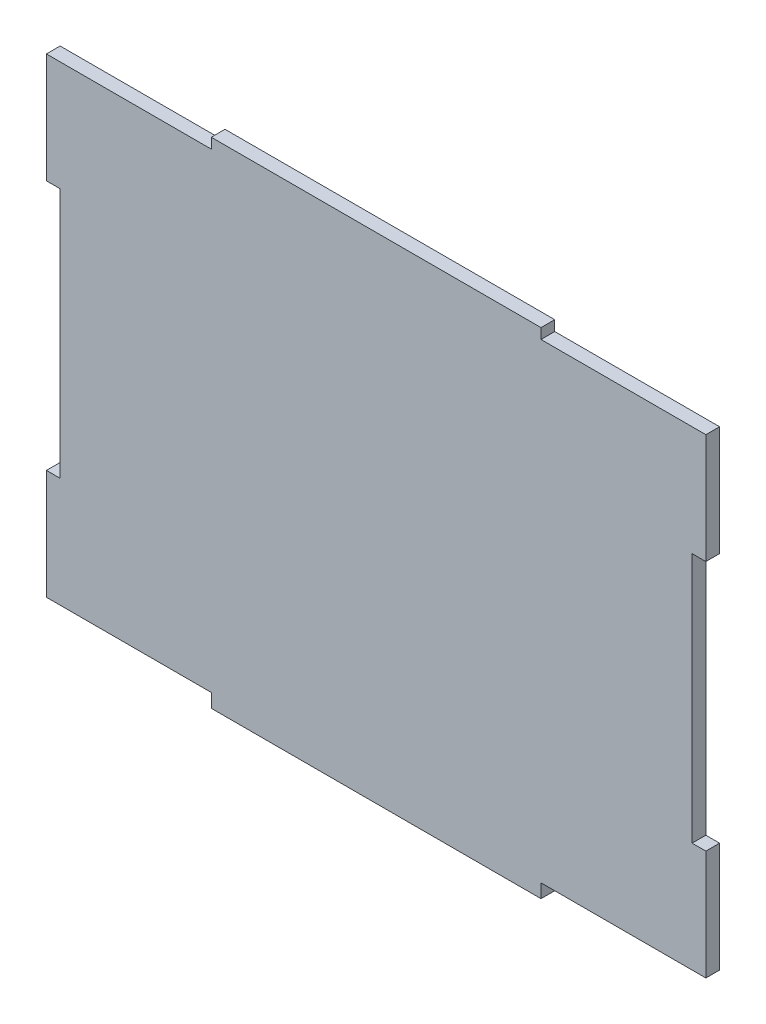
ISO-10303-21;
HEADER;
FILE_DESCRIPTION(('STEP AP214'),'2;1');
FILE_NAME('part.step','',(''),(''),'','','');
FILE_SCHEMA(('AUTOMOTIVE_DESIGN { 1 0 10303 214 1 1 1 1 }'));
ENDSEC;
DATA;
#1=APPLICATION_CONTEXT('core data for automotive mechanical design processes');
#2=APPLICATION_PROTOCOL_DEFINITION('international standard','automotive_design',2000,#1);
#3=PRODUCT_CONTEXT('',#1,'mechanical');
#4=PRODUCT('Part','Part','',(#3));
#5=PRODUCT_RELATED_PRODUCT_CATEGORY('part','',(#4));
#6=PRODUCT_DEFINITION_FORMATION('','',#4);
#7=PRODUCT_DEFINITION_CONTEXT('part definition',#1,'design');
#8=PRODUCT_DEFINITION('design','',#6,#7);
#9=PRODUCT_DEFINITION_SHAPE('','',#8);
#10=(LENGTH_UNIT() NAMED_UNIT(*) SI_UNIT(.MILLI.,.METRE.));
#11=(NAMED_UNIT(*) PLANE_ANGLE_UNIT() SI_UNIT($,.RADIAN.));
#12=(NAMED_UNIT(*) SI_UNIT($,.STERADIAN.) SOLID_ANGLE_UNIT());
#13=UNCERTAINTY_MEASURE_WITH_UNIT(LENGTH_MEASURE(1.E-05),#10,'distance_accuracy_value','');
#14=(GEOMETRIC_REPRESENTATION_CONTEXT(3) GLOBAL_UNCERTAINTY_ASSIGNED_CONTEXT((#13)) GLOBAL_UNIT_ASSIGNED_CONTEXT((#10,
#11,#12)) REPRESENTATION_CONTEXT('',''));
#15=CARTESIAN_POINT('',(0.,0.,0.));
#16=DIRECTION('',(0.,0.,1.));
#17=DIRECTION('',(1.,0.,0.));
#18=AXIS2_PLACEMENT_3D('',#15,#16,#17);
#19=CARTESIAN_POINT('',(50.0272444260496,49.5737704918033,2.));
#20=DIRECTION('',(-1.,0.,0.));
#21=DIRECTION('',(0.,0.,1.));
#22=AXIS2_PLACEMENT_3D('',#19,#20,#21);
#23=PLANE('',#22);
#24=DIRECTION('',(0.,1.,0.));
#25=VECTOR('',#24,1.);
#26=CARTESIAN_POINT('',(50.0272444260496,49.5737704918033,2.));
#27=LINE('',#26,#25);
#28=CARTESIAN_POINT('',(50.0272444260501,32.0737704918033,2.));
#29=VERTEX_POINT('',#28);
#30=CARTESIAN_POINT('',(50.0272444260504,48.0737704918092,2.));
#31=VERTEX_POINT('',#30);
#32=EDGE_CURVE('E196',#29,#31,#27,.T.);
#33=ORIENTED_EDGE('',*,*,#32,.F.);
#34=DIRECTION('',(0.,0.,-1.));
#35=VECTOR('',#34,1.);
#36=CARTESIAN_POINT('',(50.0272444260501,32.0737704918033,2.));
#37=LINE('',#36,#35);
#38=CARTESIAN_POINT('',(50.0272444260501,32.0737704918033,0.));
#39=VERTEX_POINT('',#38);
#40=EDGE_CURVE('E309',#29,#39,#37,.T.);
#41=ORIENTED_EDGE('',*,*,#40,.T.);
#42=DIRECTION('',(0.,1.,0.));
#43=VECTOR('',#42,1.);
#44=CARTESIAN_POINT('',(50.0272444260496,49.5737704918033,0.));
#45=LINE('',#44,#43);
#46=CARTESIAN_POINT('',(50.0272444260496,48.0737704918092,0.));
#47=VERTEX_POINT('',#46);
#48=EDGE_CURVE('E211',#39,#47,#45,.T.);
#49=ORIENTED_EDGE('',*,*,#48,.T.);
#50=DIRECTION('',(0.,0.,-1.));
#51=VECTOR('',#50,1.);
#52=CARTESIAN_POINT('',(50.0272444260504,48.0737704918092,2.));
#53=LINE('',#52,#51);
#54=EDGE_CURVE('E277',#31,#47,#53,.T.);
#55=ORIENTED_EDGE('',*,*,#54,.F.);
#56=EDGE_LOOP('',(#33,#41,#49,#55));
#57=FACE_BOUND('',#56,.T.);
#58=ADVANCED_FACE('F33',(#57),#23,.F.);
#59=CARTESIAN_POINT('',(-45.9727555739504,49.5737704918033,2.));
#60=DIRECTION('',(1.,0.,0.));
#61=DIRECTION('',(0.,1.,0.));
#62=AXIS2_PLACEMENT_3D('',#59,#60,#61);
#63=PLANE('',#62);
#64=DIRECTION('',(0.,-1.,0.));
#65=VECTOR('',#64,1.);
#66=CARTESIAN_POINT('',(-45.9727555739504,49.5737704918033,2.));
#67=LINE('',#66,#65);
#68=CARTESIAN_POINT('',(-45.9727555739499,-4.42622950819673,2.));
#69=VERTEX_POINT('',#68);
#70=CARTESIAN_POINT('',(-45.9727555739504,-20.4262295081967,2.));
#71=VERTEX_POINT('',#70);
#72=EDGE_CURVE('E214',#69,#71,#67,.T.);
#73=ORIENTED_EDGE('',*,*,#72,.F.);
#74=DIRECTION('',(0.,0.,-1.));
#75=VECTOR('',#74,1.);
#76=CARTESIAN_POINT('',(-45.9727555739499,-4.42622950819673,2.));
#77=LINE('',#76,#75);
#78=CARTESIAN_POINT('',(-45.9727555739499,-4.42622950819673,0.));
#79=VERTEX_POINT('',#78);
#80=EDGE_CURVE('E288',#69,#79,#77,.T.);
#81=ORIENTED_EDGE('',*,*,#80,.T.);
#82=DIRECTION('',(0.,-1.,0.));
#83=VECTOR('',#82,1.);
#84=CARTESIAN_POINT('',(-45.9727555739504,49.5737704918033,0.));
#85=LINE('',#84,#83);
#86=CARTESIAN_POINT('',(-45.9727555739504,-20.4262295081967,0.));
#87=VERTEX_POINT('',#86);
#88=EDGE_CURVE('E208',#79,#87,#85,.T.);
#89=ORIENTED_EDGE('',*,*,#88,.T.);
#90=DIRECTION('',(0.,0.,-1.));
#91=VECTOR('',#90,1.);
#92=CARTESIAN_POINT('',(-45.9727555739504,-20.4262295081967,2.));
#93=LINE('',#92,#91);
#94=EDGE_CURVE('E231',#71,#87,#93,.T.);
#95=ORIENTED_EDGE('',*,*,#94,.F.);
#96=EDGE_LOOP('',(#73,#81,#89,#95));
#97=FACE_BOUND('',#96,.T.);
#98=ADVANCED_FACE('F370',(#97),#63,.F.);
#99=CARTESIAN_POINT('',(-45.9727555739496,48.0737704918092,0.));
#100=VERTEX_POINT('',#99);
#101=CARTESIAN_POINT('',(-45.9727555739504,32.0737704918033,0.));
#102=VERTEX_POINT('',#101);
#103=EDGE_CURVE('E204',#100,#102,#85,.T.);
#104=ORIENTED_EDGE('',*,*,#103,.T.);
#105=DIRECTION('',(0.,0.,-1.));
#106=VECTOR('',#105,1.);
#107=CARTESIAN_POINT('',(-45.9727555739499,32.0737704918033,2.));
#108=LINE('',#107,#106);
#109=CARTESIAN_POINT('',(-45.9727555739499,32.0737704918033,2.));
#110=VERTEX_POINT('',#109);
#111=EDGE_CURVE('E56',#110,#102,#108,.T.);
#112=ORIENTED_EDGE('',*,*,#111,.F.);
#113=CARTESIAN_POINT('',(-45.9727555739496,48.0737704918092,2.));
#114=VERTEX_POINT('',#113);
#115=EDGE_CURVE('E219',#114,#110,#67,.T.);
#116=ORIENTED_EDGE('',*,*,#115,.F.);
#117=DIRECTION('',(0.,0.,-1.));
#118=VECTOR('',#117,1.);
#119=CARTESIAN_POINT('',(-45.9727555739496,48.0737704918092,2.));
#120=LINE('',#119,#118);
#121=EDGE_CURVE('E252',#114,#100,#120,.T.);
#122=ORIENTED_EDGE('',*,*,#121,.T.);
#123=EDGE_LOOP('',(#104,#112,#116,#122));
#124=FACE_BOUND('',#123,.T.);
#125=ADVANCED_FACE('F35',(#124),#63,.F.);
#126=CARTESIAN_POINT('',(-45.9727555739504,-22.4262295081967,2.));
#127=DIRECTION('',(0.,1.,0.));
#128=DIRECTION('',(0.,0.,1.));
#129=AXIS2_PLACEMENT_3D('',#126,#127,#128);
#130=PLANE('',#129);
#131=DIRECTION('',(1.,0.,0.));
#132=VECTOR('',#131,1.);
#133=CARTESIAN_POINT('',(-45.9727555739504,-22.4262295081967,0.));
#134=LINE('',#133,#132);
#135=CARTESIAN_POINT('',(-21.9727555739504,-22.4262295081967,0.));
#136=VERTEX_POINT('',#135);
#137=CARTESIAN_POINT('',(26.0272444260496,-22.4262295081967,0.));
#138=VERTEX_POINT('',#137);
#139=EDGE_CURVE('E207',#136,#138,#134,.T.);
#140=ORIENTED_EDGE('',*,*,#139,.T.);
#141=DIRECTION('',(0.,0.,-1.));
#142=VECTOR('',#141,1.);
#143=CARTESIAN_POINT('',(26.0272444260496,-22.4262295081967,2.));
#144=LINE('',#143,#142);
#145=CARTESIAN_POINT('',(26.0272444260496,-22.4262295081967,2.));
#146=VERTEX_POINT('',#145);
#147=EDGE_CURVE('E265',#146,#138,#144,.T.);
#148=ORIENTED_EDGE('',*,*,#147,.F.);
#149=DIRECTION('',(1.,0.,0.));
#150=VECTOR('',#149,1.);
#151=CARTESIAN_POINT('',(-45.9727555739504,-22.4262295081967,2.));
#152=LINE('',#151,#150);
#153=CARTESIAN_POINT('',(-21.9727555739504,-22.4262295081967,2.));
#154=VERTEX_POINT('',#153);
#155=EDGE_CURVE('E200',#154,#146,#152,.T.);
#156=ORIENTED_EDGE('',*,*,#155,.F.);
#157=DIRECTION('',(0.,0.,-1.));
#158=VECTOR('',#157,1.);
#159=CARTESIAN_POINT('',(-21.9727555739504,-22.4262295081967,2.));
#160=LINE('',#159,#158);
#161=EDGE_CURVE('E230',#154,#136,#160,.T.);
#162=ORIENTED_EDGE('',*,*,#161,.T.);
#163=EDGE_LOOP('',(#140,#148,#156,#162));
#164=FACE_BOUND('',#163,.T.);
#165=ADVANCED_FACE('F383',(#164),#130,.F.);
#166=CARTESIAN_POINT('',(50.0272444260496,-20.4262295081967,0.));
#167=VERTEX_POINT('',#166);
#168=CARTESIAN_POINT('',(50.0272444260496,-4.4262295081967,0.));
#169=VERTEX_POINT('',#168);
#170=EDGE_CURVE('E187',#167,#169,#45,.T.);
#171=ORIENTED_EDGE('',*,*,#170,.T.);
#172=DIRECTION('',(0.,0.,-1.));
#173=VECTOR('',#172,1.);
#174=CARTESIAN_POINT('',(50.0272444260501,-4.4262295081967,2.));
#175=LINE('',#174,#173);
#176=CARTESIAN_POINT('',(50.0272444260501,-4.4262295081967,2.));
#177=VERTEX_POINT('',#176);
#178=EDGE_CURVE('E48',#177,#169,#175,.T.);
#179=ORIENTED_EDGE('',*,*,#178,.F.);
#180=CARTESIAN_POINT('',(50.0272444260496,-20.4262295081967,2.));
#181=VERTEX_POINT('',#180);
#182=EDGE_CURVE('E185',#181,#177,#27,.T.);
#183=ORIENTED_EDGE('',*,*,#182,.F.);
#184=DIRECTION('',(0.,0.,-1.));
#185=VECTOR('',#184,1.);
#186=CARTESIAN_POINT('',(50.0272444260496,-20.4262295081967,2.));
#187=LINE('',#186,#185);
#188=EDGE_CURVE('E245',#181,#167,#187,.T.);
#189=ORIENTED_EDGE('',*,*,#188,.T.);
#190=EDGE_LOOP('',(#171,#179,#183,#189));
#191=FACE_BOUND('',#190,.T.);
#192=ADVANCED_FACE('F183',(#191),#23,.F.);
#193=CARTESIAN_POINT('',(-45.9727555739504,49.5737704918033,2.));
#194=DIRECTION('',(0.,-1.,0.));
#195=DIRECTION('',(0.,0.,-1.));
#196=AXIS2_PLACEMENT_3D('',#193,#194,#195);
#197=PLANE('',#196);
#198=DIRECTION('',(-1.,0.,0.));
#199=VECTOR('',#198,1.);
#200=CARTESIAN_POINT('',(-45.9727555739504,49.5737704918033,0.));
#201=LINE('',#200,#199);
#202=CARTESIAN_POINT('',(26.0272444260504,49.5737704918033,0.));
#203=VERTEX_POINT('',#202);
#204=CARTESIAN_POINT('',(-21.9727555739496,49.5737704918033,0.));
#205=VERTEX_POINT('',#204);
#206=EDGE_CURVE('E212',#203,#205,#201,.T.);
#207=ORIENTED_EDGE('',*,*,#206,.T.);
#208=DIRECTION('',(0.,0.,1.));
#209=VECTOR('',#208,1.);
#210=CARTESIAN_POINT('',(-21.9727555739496,49.5737704918033,2.));
#211=LINE('',#210,#209);
#212=CARTESIAN_POINT('',(-21.9727555739496,49.5737704918033,2.));
#213=VERTEX_POINT('',#212);
#214=EDGE_CURVE('E226',#205,#213,#211,.T.);
#215=ORIENTED_EDGE('',*,*,#214,.T.);
#216=DIRECTION('',(-1.,0.,0.));
#217=VECTOR('',#216,1.);
#218=CARTESIAN_POINT('',(-45.9727555739504,49.5737704918033,2.));
#219=LINE('',#218,#217);
#220=CARTESIAN_POINT('',(26.0272444260504,49.5737704918033,2.));
#221=VERTEX_POINT('',#220);
#222=EDGE_CURVE('E41',#221,#213,#219,.T.);
#223=ORIENTED_EDGE('',*,*,#222,.F.);
#224=DIRECTION('',(0.,0.,-1.));
#225=VECTOR('',#224,1.);
#226=CARTESIAN_POINT('',(26.0272444260504,49.5737704918033,2.));
#227=LINE('',#226,#225);
#228=EDGE_CURVE('E228',#221,#203,#227,.T.);
#229=ORIENTED_EDGE('',*,*,#228,.T.);
#230=EDGE_LOOP('',(#207,#215,#223,#229));
#231=FACE_BOUND('',#230,.T.);
#232=ADVANCED_FACE('F349',(#231),#197,.F.);
#233=CARTESIAN_POINT('',(0.,0.,2.));
#234=DIRECTION('',(0.,0.,1.));
#235=DIRECTION('',(1.,0.,0.));
#236=AXIS2_PLACEMENT_3D('',#233,#234,#235);
#237=PLANE('',#236);
#238=DIRECTION('',(1.,0.,0.));
#239=VECTOR('',#238,1.);
#240=CARTESIAN_POINT('',(50.0272444260501,32.0737704918033,2.));
#241=LINE('',#240,#239);
#242=CARTESIAN_POINT('',(48.0272444260501,32.0737704918033,2.));
#243=VERTEX_POINT('',#242);
#244=EDGE_CURVE('E188',#243,#29,#241,.T.);
#245=ORIENTED_EDGE('',*,*,#244,.T.);
#246=ORIENTED_EDGE('',*,*,#32,.T.);
#247=DIRECTION('',(-1.,0.,0.));
#248=VECTOR('',#247,1.);
#249=CARTESIAN_POINT('',(50.0272444260504,48.0737704918092,2.));
#250=LINE('',#249,#248);
#251=CARTESIAN_POINT('',(26.0272444260504,48.0737704918092,2.));
#252=VERTEX_POINT('',#251);
#253=EDGE_CURVE('E284',#31,#252,#250,.T.);
#254=ORIENTED_EDGE('',*,*,#253,.T.);
#255=DIRECTION('',(0.,1.,0.));
#256=VECTOR('',#255,1.);
#257=CARTESIAN_POINT('',(26.0272444260504,50.0737704918092,2.));
#258=LINE('',#257,#256);
#259=EDGE_CURVE('E280',#252,#221,#258,.T.);
#260=ORIENTED_EDGE('',*,*,#259,.T.);
#261=ORIENTED_EDGE('',*,*,#222,.T.);
#262=DIRECTION('',(0.,-1.,0.));
#263=VECTOR('',#262,1.);
#264=CARTESIAN_POINT('',(-21.9727555739496,50.0737704918092,2.));
#265=LINE('',#264,#263);
#266=CARTESIAN_POINT('',(-21.9727555739496,48.0737704918092,2.));
#267=VERTEX_POINT('',#266);
#268=EDGE_CURVE('E259',#213,#267,#265,.T.);
#269=ORIENTED_EDGE('',*,*,#268,.T.);
#270=DIRECTION('',(-1.,0.,0.));
#271=VECTOR('',#270,1.);
#272=CARTESIAN_POINT('',(-45.9727555739496,48.0737704918092,2.));
#273=LINE('',#272,#271);
#274=EDGE_CURVE('E253',#267,#114,#273,.T.);
#275=ORIENTED_EDGE('',*,*,#274,.T.);
#276=ORIENTED_EDGE('',*,*,#115,.T.);
#277=DIRECTION('',(1.,0.,0.));
#278=VECTOR('',#277,1.);
#279=CARTESIAN_POINT('',(-45.9727555739499,32.0737704918033,2.));
#280=LINE('',#279,#278);
#281=CARTESIAN_POINT('',(-43.9727555739499,32.0737704918033,2.));
#282=VERTEX_POINT('',#281);
#283=EDGE_CURVE('E303',#110,#282,#280,.T.);
#284=ORIENTED_EDGE('',*,*,#283,.T.);
#285=DIRECTION('',(0.,-1.,0.));
#286=VECTOR('',#285,1.);
#287=CARTESIAN_POINT('',(-43.9727555739499,-4.42622950819673,2.));
#288=LINE('',#287,#286);
#289=CARTESIAN_POINT('',(-43.9727555739499,-4.42622950819673,2.));
#290=VERTEX_POINT('',#289);
#291=EDGE_CURVE('E311',#282,#290,#288,.T.);
#292=ORIENTED_EDGE('',*,*,#291,.T.);
#293=DIRECTION('',(-1.,0.,0.));
#294=VECTOR('',#293,1.);
#295=CARTESIAN_POINT('',(-45.9727555739499,-4.42622950819673,2.));
#296=LINE('',#295,#294);
#297=EDGE_CURVE('E295',#290,#69,#296,.T.);
#298=ORIENTED_EDGE('',*,*,#297,.T.);
#299=ORIENTED_EDGE('',*,*,#72,.T.);
#300=DIRECTION('',(1.,0.,0.));
#301=VECTOR('',#300,1.);
#302=CARTESIAN_POINT('',(-45.9727555739504,-20.4262295081967,2.));
#303=LINE('',#302,#301);
#304=CARTESIAN_POINT('',(-21.9727555739504,-20.4262295081967,2.));
#305=VERTEX_POINT('',#304);
#306=EDGE_CURVE('E241',#71,#305,#303,.T.);
#307=ORIENTED_EDGE('',*,*,#306,.T.);
#308=DIRECTION('',(0.,-1.,0.));
#309=VECTOR('',#308,1.);
#310=CARTESIAN_POINT('',(-21.9727555739504,-22.4262295081967,2.));
#311=LINE('',#310,#309);
#312=EDGE_CURVE('E235',#305,#154,#311,.T.);
#313=ORIENTED_EDGE('',*,*,#312,.T.);
#314=ORIENTED_EDGE('',*,*,#155,.T.);
#315=DIRECTION('',(0.,1.,0.));
#316=VECTOR('',#315,1.);
#317=CARTESIAN_POINT('',(26.0272444260496,-22.4262295081967,2.));
#318=LINE('',#317,#316);
#319=CARTESIAN_POINT('',(26.0272444260496,-20.4262295081967,2.));
#320=VERTEX_POINT('',#319);
#321=EDGE_CURVE('E272',#146,#320,#318,.T.);
#322=ORIENTED_EDGE('',*,*,#321,.T.);
#323=DIRECTION('',(1.,0.,0.));
#324=VECTOR('',#323,1.);
#325=CARTESIAN_POINT('',(50.0272444260496,-20.4262295081967,2.));
#326=LINE('',#325,#324);
#327=EDGE_CURVE('E195',#320,#181,#326,.T.);
#328=ORIENTED_EDGE('',*,*,#327,.T.);
#329=ORIENTED_EDGE('',*,*,#182,.T.);
#330=DIRECTION('',(-1.,0.,0.));
#331=VECTOR('',#330,1.);
#332=CARTESIAN_POINT('',(50.0272444260501,-4.4262295081967,2.));
#333=LINE('',#332,#331);
#334=CARTESIAN_POINT('',(48.0272444260501,-4.4262295081967,2.));
#335=VERTEX_POINT('',#334);
#336=EDGE_CURVE('E170',#177,#335,#333,.T.);
#337=ORIENTED_EDGE('',*,*,#336,.T.);
#338=DIRECTION('',(0.,1.,0.));
#339=VECTOR('',#338,1.);
#340=CARTESIAN_POINT('',(48.0272444260501,-4.4262295081967,2.));
#341=LINE('',#340,#339);
#342=EDGE_CURVE('E177',#335,#243,#341,.T.);
#343=ORIENTED_EDGE('',*,*,#342,.T.);
#344=EDGE_LOOP('',(#245,#246,#254,#260,#261,#269,#275,#276,#284,#292,#298,#299,#307,#313,#314,
#322,#328,#329,#337,#343));
#345=FACE_BOUND('',#344,.T.);
#346=ADVANCED_FACE('F192',(#345),#237,.T.);
#347=CARTESIAN_POINT('',(0.,0.,0.));
#348=DIRECTION('',(0.,0.,1.));
#349=DIRECTION('',(1.,0.,0.));
#350=AXIS2_PLACEMENT_3D('',#347,#348,#349);
#351=PLANE('',#350);
#352=ORIENTED_EDGE('',*,*,#48,.F.);
#353=DIRECTION('',(1.,0.,0.));
#354=VECTOR('',#353,1.);
#355=CARTESIAN_POINT('',(50.0272444260501,32.0737704918033,0.));
#356=LINE('',#355,#354);
#357=CARTESIAN_POINT('',(48.0272444260501,32.0737704918033,0.));
#358=VERTEX_POINT('',#357);
#359=EDGE_CURVE('E178',#358,#39,#356,.T.);
#360=ORIENTED_EDGE('',*,*,#359,.F.);
#361=DIRECTION('',(0.,1.,0.));
#362=VECTOR('',#361,1.);
#363=CARTESIAN_POINT('',(48.0272444260501,-4.4262295081967,0.));
#364=LINE('',#363,#362);
#365=CARTESIAN_POINT('',(48.0272444260501,-4.4262295081967,0.));
#366=VERTEX_POINT('',#365);
#367=EDGE_CURVE('E322',#366,#358,#364,.T.);
#368=ORIENTED_EDGE('',*,*,#367,.F.);
#369=DIRECTION('',(-1.,0.,0.));
#370=VECTOR('',#369,1.);
#371=CARTESIAN_POINT('',(50.0272444260501,-4.4262295081967,0.));
#372=LINE('',#371,#370);
#373=EDGE_CURVE('E325',#169,#366,#372,.T.);
#374=ORIENTED_EDGE('',*,*,#373,.F.);
#375=ORIENTED_EDGE('',*,*,#170,.F.);
#376=DIRECTION('',(1.,0.,0.));
#377=VECTOR('',#376,1.);
#378=CARTESIAN_POINT('',(50.0272444260496,-20.4262295081967,0.));
#379=LINE('',#378,#377);
#380=CARTESIAN_POINT('',(26.0272444260496,-20.4262295081967,0.));
#381=VERTEX_POINT('',#380);
#382=EDGE_CURVE('E270',#381,#167,#379,.T.);
#383=ORIENTED_EDGE('',*,*,#382,.F.);
#384=DIRECTION('',(0.,1.,0.));
#385=VECTOR('',#384,1.);
#386=CARTESIAN_POINT('',(26.0272444260496,-22.4262295081967,0.));
#387=LINE('',#386,#385);
#388=EDGE_CURVE('E256',#138,#381,#387,.T.);
#389=ORIENTED_EDGE('',*,*,#388,.F.);
#390=ORIENTED_EDGE('',*,*,#139,.F.);
#391=DIRECTION('',(0.,-1.,0.));
#392=VECTOR('',#391,1.);
#393=CARTESIAN_POINT('',(-21.9727555739504,-22.4262295081967,0.));
#394=LINE('',#393,#392);
#395=CARTESIAN_POINT('',(-21.9727555739504,-20.4262295081967,0.));
#396=VERTEX_POINT('',#395);
#397=EDGE_CURVE('E239',#396,#136,#394,.T.);
#398=ORIENTED_EDGE('',*,*,#397,.F.);
#399=DIRECTION('',(1.,0.,0.));
#400=VECTOR('',#399,1.);
#401=CARTESIAN_POINT('',(-45.9727555739504,-20.4262295081967,0.));
#402=LINE('',#401,#400);
#403=EDGE_CURVE('E242',#87,#396,#402,.T.);
#404=ORIENTED_EDGE('',*,*,#403,.F.);
#405=ORIENTED_EDGE('',*,*,#88,.F.);
#406=DIRECTION('',(-1.,0.,0.));
#407=VECTOR('',#406,1.);
#408=CARTESIAN_POINT('',(-45.9727555739499,-4.42622950819673,0.));
#409=LINE('',#408,#407);
#410=CARTESIAN_POINT('',(-43.9727555739499,-4.42622950819673,0.));
#411=VERTEX_POINT('',#410);
#412=EDGE_CURVE('E301',#411,#79,#409,.T.);
#413=ORIENTED_EDGE('',*,*,#412,.F.);
#414=DIRECTION('',(0.,-1.,0.));
#415=VECTOR('',#414,1.);
#416=CARTESIAN_POINT('',(-43.9727555739499,-4.42622950819673,0.));
#417=LINE('',#416,#415);
#418=CARTESIAN_POINT('',(-43.9727555739499,32.0737704918033,0.));
#419=VERTEX_POINT('',#418);
#420=EDGE_CURVE('E304',#419,#411,#417,.T.);
#421=ORIENTED_EDGE('',*,*,#420,.F.);
#422=DIRECTION('',(1.,0.,0.));
#423=VECTOR('',#422,1.);
#424=CARTESIAN_POINT('',(-45.9727555739499,32.0737704918033,0.));
#425=LINE('',#424,#423);
#426=EDGE_CURVE('E307',#102,#419,#425,.T.);
#427=ORIENTED_EDGE('',*,*,#426,.F.);
#428=ORIENTED_EDGE('',*,*,#103,.F.);
#429=DIRECTION('',(-1.,0.,0.));
#430=VECTOR('',#429,1.);
#431=CARTESIAN_POINT('',(-45.9727555739496,48.0737704918092,0.));
#432=LINE('',#431,#430);
#433=CARTESIAN_POINT('',(-21.9727555739496,48.0737704918092,0.));
#434=VERTEX_POINT('',#433);
#435=EDGE_CURVE('E257',#434,#100,#432,.T.);
#436=ORIENTED_EDGE('',*,*,#435,.F.);
#437=DIRECTION('',(0.,1.,0.));
#438=VECTOR('',#437,1.);
#439=CARTESIAN_POINT('',(-21.9727555739496,0.,0.));
#440=LINE('',#439,#438);
#441=EDGE_CURVE('E11',#434,#205,#440,.T.);
#442=ORIENTED_EDGE('',*,*,#441,.T.);
#443=ORIENTED_EDGE('',*,*,#206,.F.);
#444=DIRECTION('',(0.,1.,0.));
#445=VECTOR('',#444,1.);
#446=CARTESIAN_POINT('',(26.0272444260504,50.0737704918092,0.));
#447=LINE('',#446,#445);
#448=CARTESIAN_POINT('',(26.0272444260504,48.0737704918092,0.));
#449=VERTEX_POINT('',#448);
#450=EDGE_CURVE('E282',#449,#203,#447,.T.);
#451=ORIENTED_EDGE('',*,*,#450,.F.);
#452=DIRECTION('',(-1.,0.,0.));
#453=VECTOR('',#452,1.);
#454=CARTESIAN_POINT('',(50.0272444260504,48.0737704918092,0.));
#455=LINE('',#454,#453);
#456=EDGE_CURVE('E285',#47,#449,#455,.T.);
#457=ORIENTED_EDGE('',*,*,#456,.F.);
#458=EDGE_LOOP('',(#352,#360,#368,#374,#375,#383,#389,#390,#398,#404,#405,#413,#421,#427,#428,
#436,#442,#443,#451,#457));
#459=FACE_BOUND('',#458,.T.);
#460=ADVANCED_FACE('F341',(#459),#351,.F.);
#461=CARTESIAN_POINT('',(-21.9727555739504,-22.4262295081967,2.));
#462=DIRECTION('',(1.,0.,0.));
#463=DIRECTION('',(0.,0.,-1.));
#464=AXIS2_PLACEMENT_3D('',#461,#462,#463);
#465=PLANE('',#464);
#466=ORIENTED_EDGE('',*,*,#397,.T.);
#467=ORIENTED_EDGE('',*,*,#161,.F.);
#468=ORIENTED_EDGE('',*,*,#312,.F.);
#469=DIRECTION('',(0.,0.,-1.));
#470=VECTOR('',#469,1.);
#471=CARTESIAN_POINT('',(-21.9727555739504,-20.4262295081967,2.));
#472=LINE('',#471,#470);
#473=EDGE_CURVE('E234',#305,#396,#472,.T.);
#474=ORIENTED_EDGE('',*,*,#473,.T.);
#475=EDGE_LOOP('',(#466,#467,#468,#474));
#476=FACE_BOUND('',#475,.T.);
#477=ADVANCED_FACE('F379',(#476),#465,.F.);
#478=CARTESIAN_POINT('',(-45.9727555739504,-20.4262295081967,2.));
#479=DIRECTION('',(0.,1.,0.));
#480=DIRECTION('',(0.,0.,1.));
#481=AXIS2_PLACEMENT_3D('',#478,#479,#480);
#482=PLANE('',#481);
#483=ORIENTED_EDGE('',*,*,#403,.T.);
#484=ORIENTED_EDGE('',*,*,#473,.F.);
#485=ORIENTED_EDGE('',*,*,#306,.F.);
#486=ORIENTED_EDGE('',*,*,#94,.T.);
#487=EDGE_LOOP('',(#483,#484,#485,#486));
#488=FACE_BOUND('',#487,.T.);
#489=ADVANCED_FACE('F374',(#488),#482,.F.);
#490=CARTESIAN_POINT('',(26.0272444260504,50.0737704918092,2.));
#491=DIRECTION('',(-1.,0.,0.));
#492=DIRECTION('',(0.,0.,1.));
#493=AXIS2_PLACEMENT_3D('',#490,#491,#492);
#494=PLANE('',#493);
#495=ORIENTED_EDGE('',*,*,#259,.F.);
#496=DIRECTION('',(0.,0.,-1.));
#497=VECTOR('',#496,1.);
#498=CARTESIAN_POINT('',(26.0272444260504,48.0737704918092,2.));
#499=LINE('',#498,#497);
#500=EDGE_CURVE('E260',#252,#449,#499,.T.);
#501=ORIENTED_EDGE('',*,*,#500,.T.);
#502=ORIENTED_EDGE('',*,*,#450,.T.);
#503=ORIENTED_EDGE('',*,*,#228,.F.);
#504=EDGE_LOOP('',(#495,#501,#502,#503));
#505=FACE_BOUND('',#504,.T.);
#506=ADVANCED_FACE('F507',(#505),#494,.F.);
#507=CARTESIAN_POINT('',(50.0272444260504,48.0737704918092,2.));
#508=DIRECTION('',(0.,-1.,0.));
#509=DIRECTION('',(0.,0.,-1.));
#510=AXIS2_PLACEMENT_3D('',#507,#508,#509);
#511=PLANE('',#510);
#512=ORIENTED_EDGE('',*,*,#456,.T.);
#513=ORIENTED_EDGE('',*,*,#500,.F.);
#514=ORIENTED_EDGE('',*,*,#253,.F.);
#515=ORIENTED_EDGE('',*,*,#54,.T.);
#516=EDGE_LOOP('',(#512,#513,#514,#515));
#517=FACE_BOUND('',#516,.T.);
#518=ADVANCED_FACE('F344',(#517),#511,.F.);
#519=CARTESIAN_POINT('',(-21.9727555739496,50.0737704918092,2.));
#520=DIRECTION('',(1.,0.,0.));
#521=DIRECTION('',(0.,0.,-1.));
#522=AXIS2_PLACEMENT_3D('',#519,#520,#521);
#523=PLANE('',#522);
#524=ORIENTED_EDGE('',*,*,#441,.F.);
#525=DIRECTION('',(0.,0.,-1.));
#526=VECTOR('',#525,1.);
#527=CARTESIAN_POINT('',(-21.9727555739496,48.0737704918092,2.));
#528=LINE('',#527,#526);
#529=EDGE_CURVE('E249',#267,#434,#528,.T.);
#530=ORIENTED_EDGE('',*,*,#529,.F.);
#531=ORIENTED_EDGE('',*,*,#268,.F.);
#532=ORIENTED_EDGE('',*,*,#214,.F.);
#533=EDGE_LOOP('',(#524,#530,#531,#532));
#534=FACE_BOUND('',#533,.T.);
#535=ADVANCED_FACE('F351',(#534),#523,.F.);
#536=CARTESIAN_POINT('',(-45.9727555739496,48.0737704918092,2.));
#537=DIRECTION('',(0.,-1.,0.));
#538=DIRECTION('',(0.,0.,-1.));
#539=AXIS2_PLACEMENT_3D('',#536,#537,#538);
#540=PLANE('',#539);
#541=ORIENTED_EDGE('',*,*,#435,.T.);
#542=ORIENTED_EDGE('',*,*,#121,.F.);
#543=ORIENTED_EDGE('',*,*,#274,.F.);
#544=ORIENTED_EDGE('',*,*,#529,.T.);
#545=EDGE_LOOP('',(#541,#542,#543,#544));
#546=FACE_BOUND('',#545,.T.);
#547=ADVANCED_FACE('F355',(#546),#540,.F.);
#548=CARTESIAN_POINT('',(50.0272444260496,-20.4262295081967,2.));
#549=DIRECTION('',(0.,1.,0.));
#550=DIRECTION('',(0.,0.,1.));
#551=AXIS2_PLACEMENT_3D('',#548,#549,#550);
#552=PLANE('',#551);
#553=ORIENTED_EDGE('',*,*,#382,.T.);
#554=ORIENTED_EDGE('',*,*,#188,.F.);
#555=ORIENTED_EDGE('',*,*,#327,.F.);
#556=DIRECTION('',(0.,0.,-1.));
#557=VECTOR('',#556,1.);
#558=CARTESIAN_POINT('',(26.0272444260496,-20.4262295081967,2.));
#559=LINE('',#558,#557);
#560=EDGE_CURVE('E267',#320,#381,#559,.T.);
#561=ORIENTED_EDGE('',*,*,#560,.T.);
#562=EDGE_LOOP('',(#553,#554,#555,#561));
#563=FACE_BOUND('',#562,.T.);
#564=ADVANCED_FACE('F390',(#563),#552,.F.);
#565=CARTESIAN_POINT('',(26.0272444260496,-22.4262295081967,2.));
#566=DIRECTION('',(-1.,0.,0.));
#567=DIRECTION('',(0.,0.,1.));
#568=AXIS2_PLACEMENT_3D('',#565,#566,#567);
#569=PLANE('',#568);
#570=ORIENTED_EDGE('',*,*,#388,.T.);
#571=ORIENTED_EDGE('',*,*,#560,.F.);
#572=ORIENTED_EDGE('',*,*,#321,.F.);
#573=ORIENTED_EDGE('',*,*,#147,.T.);
#574=EDGE_LOOP('',(#570,#571,#572,#573));
#575=FACE_BOUND('',#574,.T.);
#576=ADVANCED_FACE('F387',(#575),#569,.F.);
#577=CARTESIAN_POINT('',(-45.9727555739499,-4.42622950819673,2.));
#578=DIRECTION('',(0.,-1.,0.));
#579=DIRECTION('',(0.,0.,-1.));
#580=AXIS2_PLACEMENT_3D('',#577,#578,#579);
#581=PLANE('',#580);
#582=ORIENTED_EDGE('',*,*,#412,.T.);
#583=ORIENTED_EDGE('',*,*,#80,.F.);
#584=ORIENTED_EDGE('',*,*,#297,.F.);
#585=DIRECTION('',(0.,0.,-1.));
#586=VECTOR('',#585,1.);
#587=CARTESIAN_POINT('',(-43.9727555739499,-4.42622950819673,2.));
#588=LINE('',#587,#586);
#589=EDGE_CURVE('E297',#290,#411,#588,.T.);
#590=ORIENTED_EDGE('',*,*,#589,.T.);
#591=EDGE_LOOP('',(#582,#583,#584,#590));
#592=FACE_BOUND('',#591,.T.);
#593=ADVANCED_FACE('F367',(#592),#581,.F.);
#594=CARTESIAN_POINT('',(-43.9727555739499,-4.42622950819673,2.));
#595=DIRECTION('',(1.,0.,0.));
#596=DIRECTION('',(0.,0.,-1.));
#597=AXIS2_PLACEMENT_3D('',#594,#595,#596);
#598=PLANE('',#597);
#599=ORIENTED_EDGE('',*,*,#420,.T.);
#600=ORIENTED_EDGE('',*,*,#589,.F.);
#601=ORIENTED_EDGE('',*,*,#291,.F.);
#602=DIRECTION('',(0.,0.,-1.));
#603=VECTOR('',#602,1.);
#604=CARTESIAN_POINT('',(-43.9727555739499,32.0737704918033,2.));
#605=LINE('',#604,#603);
#606=EDGE_CURVE('E294',#282,#419,#605,.T.);
#607=ORIENTED_EDGE('',*,*,#606,.T.);
#608=EDGE_LOOP('',(#599,#600,#601,#607));
#609=FACE_BOUND('',#608,.T.);
#610=ADVANCED_FACE('F363',(#609),#598,.F.);
#611=CARTESIAN_POINT('',(-45.9727555739499,32.0737704918033,2.));
#612=DIRECTION('',(0.,1.,0.));
#613=DIRECTION('',(0.,0.,1.));
#614=AXIS2_PLACEMENT_3D('',#611,#612,#613);
#615=PLANE('',#614);
#616=ORIENTED_EDGE('',*,*,#426,.T.);
#617=ORIENTED_EDGE('',*,*,#606,.F.);
#618=ORIENTED_EDGE('',*,*,#283,.F.);
#619=ORIENTED_EDGE('',*,*,#111,.T.);
#620=EDGE_LOOP('',(#616,#617,#618,#619));
#621=FACE_BOUND('',#620,.T.);
#622=ADVANCED_FACE('F360',(#621),#615,.F.);
#623=CARTESIAN_POINT('',(50.0272444260501,32.0737704918033,2.));
#624=DIRECTION('',(0.,1.,0.));
#625=DIRECTION('',(0.,0.,1.));
#626=AXIS2_PLACEMENT_3D('',#623,#624,#625);
#627=PLANE('',#626);
#628=ORIENTED_EDGE('',*,*,#359,.T.);
#629=ORIENTED_EDGE('',*,*,#40,.F.);
#630=ORIENTED_EDGE('',*,*,#244,.F.);
#631=DIRECTION('',(0.,0.,-1.));
#632=VECTOR('',#631,1.);
#633=CARTESIAN_POINT('',(48.0272444260501,32.0737704918033,2.));
#634=LINE('',#633,#632);
#635=EDGE_CURVE('E317',#243,#358,#634,.T.);
#636=ORIENTED_EDGE('',*,*,#635,.T.);
#637=EDGE_LOOP('',(#628,#629,#630,#636));
#638=FACE_BOUND('',#637,.T.);
#639=ADVANCED_FACE('F335',(#638),#627,.F.);
#640=CARTESIAN_POINT('',(48.0272444260501,-4.4262295081967,2.));
#641=DIRECTION('',(-1.,0.,0.));
#642=DIRECTION('',(0.,0.,1.));
#643=AXIS2_PLACEMENT_3D('',#640,#641,#642);
#644=PLANE('',#643);
#645=ORIENTED_EDGE('',*,*,#367,.T.);
#646=ORIENTED_EDGE('',*,*,#635,.F.);
#647=ORIENTED_EDGE('',*,*,#342,.F.);
#648=DIRECTION('',(0.,0.,-1.));
#649=VECTOR('',#648,1.);
#650=CARTESIAN_POINT('',(48.0272444260501,-4.4262295081967,2.));
#651=LINE('',#650,#649);
#652=EDGE_CURVE('E172',#335,#366,#651,.T.);
#653=ORIENTED_EDGE('',*,*,#652,.T.);
#654=EDGE_LOOP('',(#645,#646,#647,#653));
#655=FACE_BOUND('',#654,.T.);
#656=ADVANCED_FACE('F331',(#655),#644,.F.);
#657=CARTESIAN_POINT('',(50.0272444260501,-4.4262295081967,2.));
#658=DIRECTION('',(0.,-1.,0.));
#659=DIRECTION('',(0.,0.,-1.));
#660=AXIS2_PLACEMENT_3D('',#657,#658,#659);
#661=PLANE('',#660);
#662=ORIENTED_EDGE('',*,*,#373,.T.);
#663=ORIENTED_EDGE('',*,*,#652,.F.);
#664=ORIENTED_EDGE('',*,*,#336,.F.);
#665=ORIENTED_EDGE('',*,*,#178,.T.);
#666=EDGE_LOOP('',(#662,#663,#664,#665));
#667=FACE_BOUND('',#666,.T.);
#668=ADVANCED_FACE('F171',(#667),#661,.F.);
#669=CLOSED_SHELL('',(#58,#98,#125,#165,#192,#232,#346,#460,#477,#489,#506,#518,#535,#547,#564,
#576,#593,#610,#622,#639,#656,#668));
#670=MANIFOLD_SOLID_BREP('B2',#669);
#671=ADVANCED_BREP_SHAPE_REPRESENTATION('',(#18,#670),#14);
#672=SHAPE_DEFINITION_REPRESENTATION(#9,#671);
ENDSEC;
END-ISO-10303-21;
